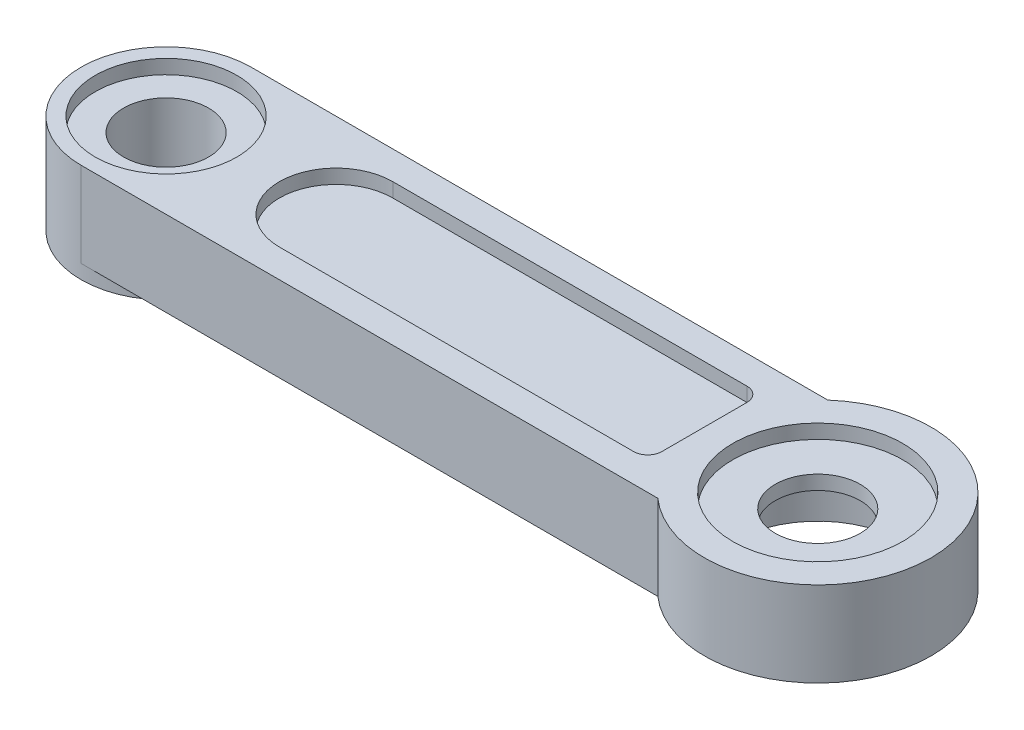
ISO-10303-21;
HEADER;
FILE_DESCRIPTION(('STEP AP214'),'2;1');
FILE_NAME('part.step','',(''),(''),'','','');
FILE_SCHEMA(('AUTOMOTIVE_DESIGN { 1 0 10303 214 1 1 1 1 }'));
ENDSEC;
DATA;
#1=APPLICATION_CONTEXT('core data for automotive mechanical design processes');
#2=APPLICATION_PROTOCOL_DEFINITION('international standard','automotive_design',2000,#1);
#3=PRODUCT_CONTEXT('',#1,'mechanical');
#4=PRODUCT('Part','Part','',(#3));
#5=PRODUCT_RELATED_PRODUCT_CATEGORY('part','',(#4));
#6=PRODUCT_DEFINITION_FORMATION('','',#4);
#7=PRODUCT_DEFINITION_CONTEXT('part definition',#1,'design');
#8=PRODUCT_DEFINITION('design','',#6,#7);
#9=PRODUCT_DEFINITION_SHAPE('','',#8);
#10=(LENGTH_UNIT() NAMED_UNIT(*) SI_UNIT(.MILLI.,.METRE.));
#11=(NAMED_UNIT(*) PLANE_ANGLE_UNIT() SI_UNIT($,.RADIAN.));
#12=(NAMED_UNIT(*) SI_UNIT($,.STERADIAN.) SOLID_ANGLE_UNIT());
#13=UNCERTAINTY_MEASURE_WITH_UNIT(LENGTH_MEASURE(1.E-05),#10,'distance_accuracy_value','');
#14=(GEOMETRIC_REPRESENTATION_CONTEXT(3) GLOBAL_UNCERTAINTY_ASSIGNED_CONTEXT((#13)) GLOBAL_UNIT_ASSIGNED_CONTEXT((#10,
#11,#12)) REPRESENTATION_CONTEXT('',''));
#15=CARTESIAN_POINT('',(0.,0.,0.));
#16=DIRECTION('',(0.,0.,1.));
#17=DIRECTION('',(1.,0.,0.));
#18=AXIS2_PLACEMENT_3D('',#15,#16,#17);
#19=CARTESIAN_POINT('',(0.,-3.,0.));
#20=DIRECTION('',(0.,1.,0.));
#21=DIRECTION('',(0.,0.,1.));
#22=AXIS2_PLACEMENT_3D('',#19,#20,#21);
#23=CYLINDRICAL_SURFACE('',#22,1.5);
#24=CARTESIAN_POINT('',(0.,-0.5,0.));
#25=DIRECTION('',(0.,1.,0.));
#26=DIRECTION('',(0.,0.,1.));
#27=AXIS2_PLACEMENT_3D('',#24,#25,#26);
#28=CIRCLE('',#27,1.5);
#29=CARTESIAN_POINT('',(0.,-0.5,1.5));
#30=VERTEX_POINT('',#29);
#31=EDGE_CURVE('E210',#30,#30,#28,.T.);
#32=ORIENTED_EDGE('',*,*,#31,.T.);
#33=EDGE_LOOP('',(#32));
#34=FACE_BOUND('',#33,.T.);
#35=CARTESIAN_POINT('',(0.,-1.,0.));
#36=DIRECTION('',(0.,-1.,0.));
#37=DIRECTION('',(0.,0.,-1.));
#38=AXIS2_PLACEMENT_3D('',#35,#36,#37);
#39=CIRCLE('',#38,1.5);
#40=CARTESIAN_POINT('',(0.,-1.,-1.5));
#41=VERTEX_POINT('',#40);
#42=EDGE_CURVE('E36',#41,#41,#39,.F.);
#43=ORIENTED_EDGE('',*,*,#42,.F.);
#44=EDGE_LOOP('',(#43));
#45=FACE_BOUND('',#44,.T.);
#46=ADVANCED_FACE('F32',(#34,#45),#23,.F.);
#47=CARTESIAN_POINT('',(0.,-3.,0.));
#48=DIRECTION('',(0.,1.,0.));
#49=DIRECTION('',(0.,0.,1.));
#50=AXIS2_PLACEMENT_3D('',#47,#48,#49);
#51=CYLINDRICAL_SURFACE('',#50,4.);
#52=DIRECTION('',(0.,1.,0.));
#53=VECTOR('',#52,1.);
#54=CARTESIAN_POINT('',(-2.64575131106459,-3.,3.));
#55=LINE('',#54,#53);
#56=CARTESIAN_POINT('',(-2.6457513110646,-3.,3.));
#57=VERTEX_POINT('',#56);
#58=CARTESIAN_POINT('',(-2.64575131106459,0.,3.));
#59=VERTEX_POINT('',#58);
#60=EDGE_CURVE('E185',#57,#59,#55,.T.);
#61=ORIENTED_EDGE('',*,*,#60,.F.);
#62=CARTESIAN_POINT('',(0.,-3.,0.));
#63=DIRECTION('',(0.,1.,0.));
#64=DIRECTION('',(0.,0.,1.));
#65=AXIS2_PLACEMENT_3D('',#62,#63,#64);
#66=CIRCLE('',#65,4.);
#67=CARTESIAN_POINT('',(-2.6457513110646,-3.,-2.99999999999999));
#68=VERTEX_POINT('',#67);
#69=EDGE_CURVE('E11',#57,#68,#66,.T.);
#70=ORIENTED_EDGE('',*,*,#69,.T.);
#71=DIRECTION('',(0.,1.,0.));
#72=VECTOR('',#71,1.);
#73=CARTESIAN_POINT('',(-2.6457513110646,-3.,-2.99999999999999));
#74=LINE('',#73,#72);
#75=CARTESIAN_POINT('',(-2.6457513110646,0.,-2.99999999999999));
#76=VERTEX_POINT('',#75);
#77=EDGE_CURVE('E171',#76,#68,#74,.F.);
#78=ORIENTED_EDGE('',*,*,#77,.F.);
#79=CARTESIAN_POINT('',(0.,0.,0.));
#80=DIRECTION('',(0.,1.,0.));
#81=DIRECTION('',(0.,0.,1.));
#82=AXIS2_PLACEMENT_3D('',#79,#80,#81);
#83=CIRCLE('',#82,4.);
#84=EDGE_CURVE('E41',#59,#76,#83,.T.);
#85=ORIENTED_EDGE('',*,*,#84,.F.);
#86=EDGE_LOOP('',(#61,#70,#78,#85));
#87=FACE_BOUND('',#86,.T.);
#88=ADVANCED_FACE('F34',(#87),#51,.T.);
#89=CARTESIAN_POINT('',(0.,-3.,0.));
#90=DIRECTION('',(0.,1.,0.));
#91=DIRECTION('',(0.,0.,1.));
#92=AXIS2_PLACEMENT_3D('',#89,#90,#91);
#93=PLANE('',#92);
#94=DIRECTION('',(1.,0.,0.));
#95=VECTOR('',#94,1.);
#96=CARTESIAN_POINT('',(-4.5,-3.,-2.));
#97=LINE('',#96,#95);
#98=CARTESIAN_POINT('',(-15.,-3.,-2.));
#99=VERTEX_POINT('',#98);
#100=CARTESIAN_POINT('',(-4.5,-3.,-2.));
#101=VERTEX_POINT('',#100);
#102=EDGE_CURVE('E542',#99,#101,#97,.T.);
#103=ORIENTED_EDGE('',*,*,#102,.F.);
#104=CARTESIAN_POINT('',(-15.,-3.,0.));
#105=DIRECTION('',(0.,-1.,0.));
#106=DIRECTION('',(0.,0.,-1.));
#107=AXIS2_PLACEMENT_3D('',#104,#105,#106);
#108=CIRCLE('',#107,2.);
#109=CARTESIAN_POINT('',(-15.,-3.,2.));
#110=VERTEX_POINT('',#109);
#111=EDGE_CURVE('E49',#110,#99,#108,.T.);
#112=ORIENTED_EDGE('',*,*,#111,.F.);
#113=DIRECTION('',(-1.,0.,0.));
#114=VECTOR('',#113,1.);
#115=CARTESIAN_POINT('',(-4.5,-3.,2.));
#116=LINE('',#115,#114);
#117=CARTESIAN_POINT('',(-4.5,-3.,2.));
#118=VERTEX_POINT('',#117);
#119=EDGE_CURVE('E525',#118,#110,#116,.T.);
#120=ORIENTED_EDGE('',*,*,#119,.F.);
#121=CARTESIAN_POINT('',(-4.5,-3.,1.5));
#122=DIRECTION('',(0.,-1.,0.));
#123=DIRECTION('',(0.,0.,-1.));
#124=AXIS2_PLACEMENT_3D('',#121,#122,#123);
#125=CIRCLE('',#124,0.5);
#126=CARTESIAN_POINT('',(-4.,-3.,1.5));
#127=VERTEX_POINT('',#126);
#128=EDGE_CURVE('E551',#127,#118,#125,.T.);
#129=ORIENTED_EDGE('',*,*,#128,.F.);
#130=DIRECTION('',(0.,0.,1.));
#131=VECTOR('',#130,1.);
#132=CARTESIAN_POINT('',(-4.,-3.,-1.5));
#133=LINE('',#132,#131);
#134=CARTESIAN_POINT('',(-4.,-3.,-1.5));
#135=VERTEX_POINT('',#134);
#136=EDGE_CURVE('E548',#135,#127,#133,.T.);
#137=ORIENTED_EDGE('',*,*,#136,.F.);
#138=CARTESIAN_POINT('',(-4.5,-3.,-1.5));
#139=DIRECTION('',(0.,-1.,0.));
#140=DIRECTION('',(0.,0.,-1.));
#141=AXIS2_PLACEMENT_3D('',#138,#139,#140);
#142=CIRCLE('',#141,0.5);
#143=EDGE_CURVE('E545',#101,#135,#142,.T.);
#144=ORIENTED_EDGE('',*,*,#143,.F.);
#145=EDGE_LOOP('',(#103,#112,#120,#129,#137,#144));
#146=FACE_BOUND('',#145,.T.);
#147=CARTESIAN_POINT('',(0.,-3.,0.));
#148=DIRECTION('',(0.,-1.,0.));
#149=DIRECTION('',(0.,0.,-1.));
#150=AXIS2_PLACEMENT_3D('',#147,#148,#149);
#151=CIRCLE('',#150,3.);
#152=CARTESIAN_POINT('',(0.,-3.,-3.));
#153=VERTEX_POINT('',#152);
#154=EDGE_CURVE('E197',#153,#153,#151,.T.);
#155=ORIENTED_EDGE('',*,*,#154,.F.);
#156=EDGE_LOOP('',(#155));
#157=FACE_BOUND('',#156,.T.);
#158=DIRECTION('',(1.,0.,0.));
#159=VECTOR('',#158,1.);
#160=CARTESIAN_POINT('',(-23.,-3.,3.00000000000001));
#161=LINE('',#160,#159);
#162=CARTESIAN_POINT('',(-23.,-3.,2.99999999999999));
#163=VERTEX_POINT('',#162);
#164=EDGE_CURVE('E153',#163,#57,#161,.T.);
#165=ORIENTED_EDGE('',*,*,#164,.F.);
#166=CARTESIAN_POINT('',(-23.,-3.,0.));
#167=DIRECTION('',(0.,1.,0.));
#168=DIRECTION('',(0.,0.,1.));
#169=AXIS2_PLACEMENT_3D('',#166,#167,#168);
#170=CIRCLE('',#169,2.99999999999999);
#171=CARTESIAN_POINT('',(-23.,-3.,-2.99999999999999));
#172=VERTEX_POINT('',#171);
#173=EDGE_CURVE('E147',#163,#172,#170,.T.);
#174=ORIENTED_EDGE('',*,*,#173,.T.);
#175=DIRECTION('',(-1.,0.,0.));
#176=VECTOR('',#175,1.);
#177=CARTESIAN_POINT('',(-23.,-3.,-2.99999999999999));
#178=LINE('',#177,#176);
#179=EDGE_CURVE('E152',#68,#172,#178,.T.);
#180=ORIENTED_EDGE('',*,*,#179,.F.);
#181=ORIENTED_EDGE('',*,*,#69,.F.);
#182=EDGE_LOOP('',(#165,#174,#180,#181));
#183=FACE_BOUND('',#182,.T.);
#184=ADVANCED_FACE('F149',(#146,#157,#183),#93,.F.);
#185=CARTESIAN_POINT('',(0.,0.,0.));
#186=DIRECTION('',(0.,1.,0.));
#187=DIRECTION('',(0.,0.,1.));
#188=AXIS2_PLACEMENT_3D('',#185,#186,#187);
#189=PLANE('',#188);
#190=CARTESIAN_POINT('',(-17.,0.,0.));
#191=DIRECTION('',(0.,1.,0.));
#192=DIRECTION('',(0.,0.,1.));
#193=AXIS2_PLACEMENT_3D('',#190,#191,#192);
#194=CIRCLE('',#193,2.);
#195=CARTESIAN_POINT('',(-17.,0.,-2.));
#196=VERTEX_POINT('',#195);
#197=CARTESIAN_POINT('',(-17.,0.,2.));
#198=VERTEX_POINT('',#197);
#199=EDGE_CURVE('E57',#196,#198,#194,.T.);
#200=ORIENTED_EDGE('',*,*,#199,.F.);
#201=DIRECTION('',(-1.,0.,0.));
#202=VECTOR('',#201,1.);
#203=CARTESIAN_POINT('',(-4.5,0.,-2.));
#204=LINE('',#203,#202);
#205=CARTESIAN_POINT('',(-4.5,0.,-2.));
#206=VERTEX_POINT('',#205);
#207=EDGE_CURVE('E571',#206,#196,#204,.T.);
#208=ORIENTED_EDGE('',*,*,#207,.F.);
#209=CARTESIAN_POINT('',(-4.5,0.,-1.5));
#210=DIRECTION('',(0.,1.,0.));
#211=DIRECTION('',(0.,0.,-1.));
#212=AXIS2_PLACEMENT_3D('',#209,#210,#211);
#213=CIRCLE('',#212,0.5);
#214=CARTESIAN_POINT('',(-4.,0.,-1.5));
#215=VERTEX_POINT('',#214);
#216=EDGE_CURVE('E597',#215,#206,#213,.T.);
#217=ORIENTED_EDGE('',*,*,#216,.F.);
#218=DIRECTION('',(0.,0.,-1.));
#219=VECTOR('',#218,1.);
#220=CARTESIAN_POINT('',(-4.,0.,1.5));
#221=LINE('',#220,#219);
#222=CARTESIAN_POINT('',(-4.,0.,1.5));
#223=VERTEX_POINT('',#222);
#224=EDGE_CURVE('E594',#223,#215,#221,.T.);
#225=ORIENTED_EDGE('',*,*,#224,.F.);
#226=CARTESIAN_POINT('',(-4.5,0.,1.5));
#227=DIRECTION('',(0.,1.,0.));
#228=DIRECTION('',(0.,0.,1.));
#229=AXIS2_PLACEMENT_3D('',#226,#227,#228);
#230=CIRCLE('',#229,0.5);
#231=CARTESIAN_POINT('',(-4.5,0.,2.));
#232=VERTEX_POINT('',#231);
#233=EDGE_CURVE('E591',#232,#223,#230,.T.);
#234=ORIENTED_EDGE('',*,*,#233,.F.);
#235=DIRECTION('',(1.,0.,0.));
#236=VECTOR('',#235,1.);
#237=CARTESIAN_POINT('',(-4.5,0.,2.));
#238=LINE('',#237,#236);
#239=EDGE_CURVE('E588',#198,#232,#238,.T.);
#240=ORIENTED_EDGE('',*,*,#239,.F.);
#241=EDGE_LOOP('',(#200,#208,#217,#225,#234,#240));
#242=FACE_BOUND('',#241,.T.);
#243=CARTESIAN_POINT('',(-23.,0.,0.));
#244=DIRECTION('',(0.,1.,0.));
#245=DIRECTION('',(0.,0.,1.));
#246=AXIS2_PLACEMENT_3D('',#243,#244,#245);
#247=CIRCLE('',#246,2.5);
#248=CARTESIAN_POINT('',(-23.,0.,2.5));
#249=VERTEX_POINT('',#248);
#250=EDGE_CURVE('E204',#249,#249,#247,.T.);
#251=ORIENTED_EDGE('',*,*,#250,.F.);
#252=EDGE_LOOP('',(#251));
#253=FACE_BOUND('',#252,.T.);
#254=DIRECTION('',(-1.,0.,0.));
#255=VECTOR('',#254,1.);
#256=CARTESIAN_POINT('',(-23.,0.,-2.99999999999999));
#257=LINE('',#256,#255);
#258=CARTESIAN_POINT('',(-23.,0.,-2.99999999999999));
#259=VERTEX_POINT('',#258);
#260=EDGE_CURVE('E175',#76,#259,#257,.T.);
#261=ORIENTED_EDGE('',*,*,#260,.T.);
#262=CARTESIAN_POINT('',(-23.,0.,0.));
#263=DIRECTION('',(0.,1.,0.));
#264=DIRECTION('',(0.,0.,1.));
#265=AXIS2_PLACEMENT_3D('',#262,#263,#264);
#266=CIRCLE('',#265,2.99999999999999);
#267=CARTESIAN_POINT('',(-23.,0.,2.99999999999999));
#268=VERTEX_POINT('',#267);
#269=EDGE_CURVE('E164',#259,#268,#266,.T.);
#270=ORIENTED_EDGE('',*,*,#269,.T.);
#271=DIRECTION('',(1.,0.,0.));
#272=VECTOR('',#271,1.);
#273=CARTESIAN_POINT('',(-23.,0.,3.00000000000001));
#274=LINE('',#273,#272);
#275=EDGE_CURVE('E172',#268,#59,#274,.T.);
#276=ORIENTED_EDGE('',*,*,#275,.T.);
#277=ORIENTED_EDGE('',*,*,#84,.T.);
#278=EDGE_LOOP('',(#261,#270,#276,#277));
#279=FACE_BOUND('',#278,.T.);
#280=CARTESIAN_POINT('',(0.,0.,0.));
#281=DIRECTION('',(0.,1.,0.));
#282=DIRECTION('',(0.,0.,1.));
#283=AXIS2_PLACEMENT_3D('',#280,#281,#282);
#284=CIRCLE('',#283,3.);
#285=CARTESIAN_POINT('',(0.,0.,3.));
#286=VERTEX_POINT('',#285);
#287=EDGE_CURVE('E178',#286,#286,#284,.T.);
#288=ORIENTED_EDGE('',*,*,#287,.F.);
#289=EDGE_LOOP('',(#288));
#290=FACE_BOUND('',#289,.T.);
#291=ADVANCED_FACE('F190',(#242,#253,#279,#290),#189,.T.);
#292=CARTESIAN_POINT('',(-23.,-3.,3.00000000000001));
#293=DIRECTION('',(0.,0.,1.));
#294=DIRECTION('',(1.,0.,0.));
#295=AXIS2_PLACEMENT_3D('',#292,#293,#294);
#296=PLANE('',#295);
#297=ORIENTED_EDGE('',*,*,#164,.T.);
#298=ORIENTED_EDGE('',*,*,#60,.T.);
#299=ORIENTED_EDGE('',*,*,#275,.F.);
#300=DIRECTION('',(0.,1.,0.));
#301=VECTOR('',#300,1.);
#302=CARTESIAN_POINT('',(-23.,-3.,3.00000000000001));
#303=LINE('',#302,#301);
#304=EDGE_CURVE('E167',#163,#268,#303,.T.);
#305=ORIENTED_EDGE('',*,*,#304,.F.);
#306=EDGE_LOOP('',(#297,#298,#299,#305));
#307=FACE_BOUND('',#306,.T.);
#308=ADVANCED_FACE('F196',(#307),#296,.T.);
#309=CARTESIAN_POINT('',(-23.,-3.,-2.99999999999999));
#310=DIRECTION('',(0.,0.,-1.));
#311=DIRECTION('',(-1.,0.,0.));
#312=AXIS2_PLACEMENT_3D('',#309,#310,#311);
#313=PLANE('',#312);
#314=ORIENTED_EDGE('',*,*,#260,.F.);
#315=ORIENTED_EDGE('',*,*,#77,.T.);
#316=ORIENTED_EDGE('',*,*,#179,.T.);
#317=DIRECTION('',(0.,1.,0.));
#318=VECTOR('',#317,1.);
#319=CARTESIAN_POINT('',(-23.,-3.,-2.99999999999999));
#320=LINE('',#319,#318);
#321=EDGE_CURVE('E160',#172,#259,#320,.T.);
#322=ORIENTED_EDGE('',*,*,#321,.T.);
#323=EDGE_LOOP('',(#314,#315,#316,#322));
#324=FACE_BOUND('',#323,.T.);
#325=ADVANCED_FACE('F169',(#324),#313,.T.);
#326=CARTESIAN_POINT('',(0.,-0.5,0.));
#327=DIRECTION('',(0.,1.,0.));
#328=DIRECTION('',(0.,0.,1.));
#329=AXIS2_PLACEMENT_3D('',#326,#327,#328);
#330=CYLINDRICAL_SURFACE('',#329,3.);
#331=CARTESIAN_POINT('',(0.,-0.5,0.));
#332=DIRECTION('',(0.,1.,0.));
#333=DIRECTION('',(0.,0.,1.));
#334=AXIS2_PLACEMENT_3D('',#331,#332,#333);
#335=CIRCLE('',#334,3.);
#336=CARTESIAN_POINT('',(0.,-0.5,3.));
#337=VERTEX_POINT('',#336);
#338=EDGE_CURVE('E181',#337,#337,#335,.T.);
#339=ORIENTED_EDGE('',*,*,#338,.F.);
#340=EDGE_LOOP('',(#339));
#341=FACE_BOUND('',#340,.T.);
#342=ORIENTED_EDGE('',*,*,#287,.T.);
#343=EDGE_LOOP('',(#342));
#344=FACE_BOUND('',#343,.T.);
#345=ADVANCED_FACE('F218',(#341,#344),#330,.F.);
#346=CARTESIAN_POINT('',(0.,-0.5,0.));
#347=DIRECTION('',(0.,1.,0.));
#348=DIRECTION('',(0.,0.,1.));
#349=AXIS2_PLACEMENT_3D('',#346,#347,#348);
#350=PLANE('',#349);
#351=ORIENTED_EDGE('',*,*,#31,.F.);
#352=EDGE_LOOP('',(#351));
#353=FACE_BOUND('',#352,.T.);
#354=ORIENTED_EDGE('',*,*,#338,.T.);
#355=EDGE_LOOP('',(#354));
#356=FACE_BOUND('',#355,.T.);
#357=ADVANCED_FACE('F240',(#353,#356),#350,.T.);
#358=CARTESIAN_POINT('',(0.,-1.,0.));
#359=DIRECTION('',(0.,-1.,0.));
#360=DIRECTION('',(0.,0.,-1.));
#361=AXIS2_PLACEMENT_3D('',#358,#359,#360);
#362=PLANE('',#361);
#363=CARTESIAN_POINT('',(0.,-1.,0.));
#364=DIRECTION('',(0.,-1.,0.));
#365=DIRECTION('',(0.,0.,-1.));
#366=AXIS2_PLACEMENT_3D('',#363,#364,#365);
#367=CIRCLE('',#366,3.);
#368=CARTESIAN_POINT('',(0.,-1.,-3.));
#369=VERTEX_POINT('',#368);
#370=EDGE_CURVE('E201',#369,#369,#367,.T.);
#371=ORIENTED_EDGE('',*,*,#370,.T.);
#372=EDGE_LOOP('',(#371));
#373=FACE_BOUND('',#372,.T.);
#374=ORIENTED_EDGE('',*,*,#42,.T.);
#375=EDGE_LOOP('',(#374));
#376=FACE_BOUND('',#375,.T.);
#377=ADVANCED_FACE('F243',(#373,#376),#362,.T.);
#378=CARTESIAN_POINT('',(0.,-1.,0.));
#379=DIRECTION('',(0.,-1.,0.));
#380=DIRECTION('',(0.,0.,-1.));
#381=AXIS2_PLACEMENT_3D('',#378,#379,#380);
#382=CYLINDRICAL_SURFACE('',#381,3.);
#383=ORIENTED_EDGE('',*,*,#370,.F.);
#384=EDGE_LOOP('',(#383));
#385=FACE_BOUND('',#384,.T.);
#386=ORIENTED_EDGE('',*,*,#154,.T.);
#387=EDGE_LOOP('',(#386));
#388=FACE_BOUND('',#387,.T.);
#389=ADVANCED_FACE('F238',(#385,#388),#382,.F.);
#390=CARTESIAN_POINT('',(-23.,-3.,0.));
#391=DIRECTION('',(0.,1.,0.));
#392=DIRECTION('',(0.,0.,1.));
#393=AXIS2_PLACEMENT_3D('',#390,#391,#392);
#394=CYLINDRICAL_SURFACE('',#393,2.99999999999999);
#395=ORIENTED_EDGE('',*,*,#321,.F.);
#396=ORIENTED_EDGE('',*,*,#173,.F.);
#397=ORIENTED_EDGE('',*,*,#304,.T.);
#398=ORIENTED_EDGE('',*,*,#269,.F.);
#399=EDGE_LOOP('',(#395,#396,#397,#398));
#400=FACE_BOUND('',#399,.T.);
#401=CARTESIAN_POINT('',(-23.,-3.5,0.));
#402=DIRECTION('',(0.,1.,0.));
#403=DIRECTION('',(0.,0.,1.));
#404=AXIS2_PLACEMENT_3D('',#401,#402,#403);
#405=CIRCLE('',#404,2.99999999999999);
#406=CARTESIAN_POINT('',(-23.,-3.5,2.99999999999999));
#407=VERTEX_POINT('',#406);
#408=EDGE_CURVE('E156',#407,#407,#405,.T.);
#409=ORIENTED_EDGE('',*,*,#408,.T.);
#410=EDGE_LOOP('',(#409));
#411=FACE_BOUND('',#410,.T.);
#412=ADVANCED_FACE('F161',(#400,#411),#394,.T.);
#413=CARTESIAN_POINT('',(-23.,-0.5,0.));
#414=DIRECTION('',(0.,1.,0.));
#415=DIRECTION('',(0.,0.,1.));
#416=AXIS2_PLACEMENT_3D('',#413,#414,#415);
#417=CYLINDRICAL_SURFACE('',#416,2.5);
#418=CARTESIAN_POINT('',(-23.,-0.5,0.));
#419=DIRECTION('',(0.,1.,0.));
#420=DIRECTION('',(0.,0.,1.));
#421=AXIS2_PLACEMENT_3D('',#418,#419,#420);
#422=CIRCLE('',#421,2.5);
#423=CARTESIAN_POINT('',(-23.,-0.5,2.5));
#424=VERTEX_POINT('',#423);
#425=EDGE_CURVE('E198',#424,#424,#422,.T.);
#426=ORIENTED_EDGE('',*,*,#425,.F.);
#427=EDGE_LOOP('',(#426));
#428=FACE_BOUND('',#427,.T.);
#429=ORIENTED_EDGE('',*,*,#250,.T.);
#430=EDGE_LOOP('',(#429));
#431=FACE_BOUND('',#430,.T.);
#432=ADVANCED_FACE('F281',(#428,#431),#417,.F.);
#433=CARTESIAN_POINT('',(-23.,-0.5,0.));
#434=DIRECTION('',(0.,1.,0.));
#435=DIRECTION('',(0.,0.,1.));
#436=AXIS2_PLACEMENT_3D('',#433,#434,#435);
#437=PLANE('',#436);
#438=CARTESIAN_POINT('',(-23.,-0.5,0.));
#439=DIRECTION('',(0.,1.,0.));
#440=DIRECTION('',(0.,0.,1.));
#441=AXIS2_PLACEMENT_3D('',#438,#439,#440);
#442=CIRCLE('',#441,1.5);
#443=CARTESIAN_POINT('',(-23.,-0.5,1.5));
#444=VERTEX_POINT('',#443);
#445=EDGE_CURVE('E515',#444,#444,#442,.T.);
#446=ORIENTED_EDGE('',*,*,#445,.F.);
#447=EDGE_LOOP('',(#446));
#448=FACE_BOUND('',#447,.T.);
#449=ORIENTED_EDGE('',*,*,#425,.T.);
#450=EDGE_LOOP('',(#449));
#451=FACE_BOUND('',#450,.T.);
#452=ADVANCED_FACE('F288',(#448,#451),#437,.T.);
#453=CARTESIAN_POINT('',(-17.,-0.5,0.));
#454=DIRECTION('',(0.,1.,0.));
#455=DIRECTION('',(0.,0.,1.));
#456=AXIS2_PLACEMENT_3D('',#453,#454,#455);
#457=CYLINDRICAL_SURFACE('',#456,2.);
#458=ORIENTED_EDGE('',*,*,#199,.T.);
#459=DIRECTION('',(0.,1.,0.));
#460=VECTOR('',#459,1.);
#461=CARTESIAN_POINT('',(-17.,-0.5,2.));
#462=LINE('',#461,#460);
#463=CARTESIAN_POINT('',(-17.,-0.5,2.));
#464=VERTEX_POINT('',#463);
#465=EDGE_CURVE('E586',#464,#198,#462,.T.);
#466=ORIENTED_EDGE('',*,*,#465,.F.);
#467=CARTESIAN_POINT('',(-17.,-0.5,0.));
#468=DIRECTION('',(0.,1.,0.));
#469=DIRECTION('',(0.,0.,1.));
#470=AXIS2_PLACEMENT_3D('',#467,#468,#469);
#471=CIRCLE('',#470,2.);
#472=CARTESIAN_POINT('',(-17.,-0.5,-2.));
#473=VERTEX_POINT('',#472);
#474=EDGE_CURVE('E567',#473,#464,#471,.T.);
#475=ORIENTED_EDGE('',*,*,#474,.F.);
#476=DIRECTION('',(0.,1.,0.));
#477=VECTOR('',#476,1.);
#478=CARTESIAN_POINT('',(-17.,-0.5,-2.));
#479=LINE('',#478,#477);
#480=EDGE_CURVE('E602',#473,#196,#479,.T.);
#481=ORIENTED_EDGE('',*,*,#480,.T.);
#482=EDGE_LOOP('',(#458,#466,#475,#481));
#483=FACE_BOUND('',#482,.T.);
#484=ADVANCED_FACE('F295',(#483),#457,.F.);
#485=CARTESIAN_POINT('',(-4.5,-0.5,-2.));
#486=DIRECTION('',(0.,0.,-1.));
#487=DIRECTION('',(-1.,0.,0.));
#488=AXIS2_PLACEMENT_3D('',#485,#486,#487);
#489=PLANE('',#488);
#490=ORIENTED_EDGE('',*,*,#207,.T.);
#491=ORIENTED_EDGE('',*,*,#480,.F.);
#492=DIRECTION('',(-1.,0.,0.));
#493=VECTOR('',#492,1.);
#494=CARTESIAN_POINT('',(-4.5,-0.5,-2.));
#495=LINE('',#494,#493);
#496=CARTESIAN_POINT('',(-4.5,-0.5,-2.));
#497=VERTEX_POINT('',#496);
#498=EDGE_CURVE('E583',#497,#473,#495,.T.);
#499=ORIENTED_EDGE('',*,*,#498,.F.);
#500=DIRECTION('',(0.,1.,0.));
#501=VECTOR('',#500,1.);
#502=CARTESIAN_POINT('',(-4.5,-0.5,-2.));
#503=LINE('',#502,#501);
#504=EDGE_CURVE('E604',#497,#206,#503,.T.);
#505=ORIENTED_EDGE('',*,*,#504,.T.);
#506=EDGE_LOOP('',(#490,#491,#499,#505));
#507=FACE_BOUND('',#506,.T.);
#508=ADVANCED_FACE('F304',(#507),#489,.F.);
#509=CARTESIAN_POINT('',(-4.5,-0.5,-1.5));
#510=DIRECTION('',(0.,1.,0.));
#511=DIRECTION('',(0.,0.,1.));
#512=AXIS2_PLACEMENT_3D('',#509,#510,#511);
#513=CYLINDRICAL_SURFACE('',#512,0.5);
#514=ORIENTED_EDGE('',*,*,#216,.T.);
#515=ORIENTED_EDGE('',*,*,#504,.F.);
#516=CARTESIAN_POINT('',(-4.5,-0.5,-1.5));
#517=DIRECTION('',(0.,1.,0.));
#518=DIRECTION('',(0.,0.,-1.));
#519=AXIS2_PLACEMENT_3D('',#516,#517,#518);
#520=CIRCLE('',#519,0.5);
#521=CARTESIAN_POINT('',(-4.,-0.5,-1.5));
#522=VERTEX_POINT('',#521);
#523=EDGE_CURVE('E580',#522,#497,#520,.T.);
#524=ORIENTED_EDGE('',*,*,#523,.F.);
#525=DIRECTION('',(0.,1.,0.));
#526=VECTOR('',#525,1.);
#527=CARTESIAN_POINT('',(-4.,-0.5,-1.5));
#528=LINE('',#527,#526);
#529=EDGE_CURVE('E606',#522,#215,#528,.T.);
#530=ORIENTED_EDGE('',*,*,#529,.T.);
#531=EDGE_LOOP('',(#514,#515,#524,#530));
#532=FACE_BOUND('',#531,.T.);
#533=ADVANCED_FACE('F311',(#532),#513,.F.);
#534=CARTESIAN_POINT('',(-4.,-0.5,1.5));
#535=DIRECTION('',(1.,0.,0.));
#536=DIRECTION('',(0.,0.,-1.));
#537=AXIS2_PLACEMENT_3D('',#534,#535,#536);
#538=PLANE('',#537);
#539=ORIENTED_EDGE('',*,*,#224,.T.);
#540=ORIENTED_EDGE('',*,*,#529,.F.);
#541=DIRECTION('',(0.,0.,-1.));
#542=VECTOR('',#541,1.);
#543=CARTESIAN_POINT('',(-4.,-0.5,1.5));
#544=LINE('',#543,#542);
#545=CARTESIAN_POINT('',(-4.,-0.5,1.5));
#546=VERTEX_POINT('',#545);
#547=EDGE_CURVE('E577',#546,#522,#544,.T.);
#548=ORIENTED_EDGE('',*,*,#547,.F.);
#549=DIRECTION('',(0.,1.,0.));
#550=VECTOR('',#549,1.);
#551=CARTESIAN_POINT('',(-4.,-0.5,1.5));
#552=LINE('',#551,#550);
#553=EDGE_CURVE('E608',#546,#223,#552,.T.);
#554=ORIENTED_EDGE('',*,*,#553,.T.);
#555=EDGE_LOOP('',(#539,#540,#548,#554));
#556=FACE_BOUND('',#555,.T.);
#557=ADVANCED_FACE('F319',(#556),#538,.F.);
#558=CARTESIAN_POINT('',(-4.5,-0.5,1.5));
#559=DIRECTION('',(0.,1.,0.));
#560=DIRECTION('',(0.,0.,1.));
#561=AXIS2_PLACEMENT_3D('',#558,#559,#560);
#562=CYLINDRICAL_SURFACE('',#561,0.5);
#563=ORIENTED_EDGE('',*,*,#233,.T.);
#564=ORIENTED_EDGE('',*,*,#553,.F.);
#565=CARTESIAN_POINT('',(-4.5,-0.5,1.5));
#566=DIRECTION('',(0.,1.,0.));
#567=DIRECTION('',(0.,0.,1.));
#568=AXIS2_PLACEMENT_3D('',#565,#566,#567);
#569=CIRCLE('',#568,0.5);
#570=CARTESIAN_POINT('',(-4.5,-0.5,2.));
#571=VERTEX_POINT('',#570);
#572=EDGE_CURVE('E574',#571,#546,#569,.T.);
#573=ORIENTED_EDGE('',*,*,#572,.F.);
#574=DIRECTION('',(0.,1.,0.));
#575=VECTOR('',#574,1.);
#576=CARTESIAN_POINT('',(-4.5,-0.5,2.));
#577=LINE('',#576,#575);
#578=EDGE_CURVE('E610',#571,#232,#577,.T.);
#579=ORIENTED_EDGE('',*,*,#578,.T.);
#580=EDGE_LOOP('',(#563,#564,#573,#579));
#581=FACE_BOUND('',#580,.T.);
#582=ADVANCED_FACE('F327',(#581),#562,.F.);
#583=CARTESIAN_POINT('',(-4.5,-0.5,2.));
#584=DIRECTION('',(0.,0.,1.));
#585=DIRECTION('',(1.,0.,0.));
#586=AXIS2_PLACEMENT_3D('',#583,#584,#585);
#587=PLANE('',#586);
#588=ORIENTED_EDGE('',*,*,#239,.T.);
#589=ORIENTED_EDGE('',*,*,#578,.F.);
#590=DIRECTION('',(1.,0.,0.));
#591=VECTOR('',#590,1.);
#592=CARTESIAN_POINT('',(-4.5,-0.5,2.));
#593=LINE('',#592,#591);
#594=EDGE_CURVE('E570',#464,#571,#593,.T.);
#595=ORIENTED_EDGE('',*,*,#594,.F.);
#596=ORIENTED_EDGE('',*,*,#465,.T.);
#597=EDGE_LOOP('',(#588,#589,#595,#596));
#598=FACE_BOUND('',#597,.T.);
#599=ADVANCED_FACE('F335',(#598),#587,.F.);
#600=CARTESIAN_POINT('',(-17.,-0.5,0.));
#601=DIRECTION('',(0.,1.,0.));
#602=DIRECTION('',(0.,0.,1.));
#603=AXIS2_PLACEMENT_3D('',#600,#601,#602);
#604=PLANE('',#603);
#605=ORIENTED_EDGE('',*,*,#474,.T.);
#606=ORIENTED_EDGE('',*,*,#594,.T.);
#607=ORIENTED_EDGE('',*,*,#572,.T.);
#608=ORIENTED_EDGE('',*,*,#547,.T.);
#609=ORIENTED_EDGE('',*,*,#523,.T.);
#610=ORIENTED_EDGE('',*,*,#498,.T.);
#611=EDGE_LOOP('',(#605,#606,#607,#608,#609,#610));
#612=FACE_BOUND('',#611,.T.);
#613=ADVANCED_FACE('F343',(#612),#604,.T.);
#614=CARTESIAN_POINT('',(-15.,-2.5,0.));
#615=DIRECTION('',(0.,-1.,0.));
#616=DIRECTION('',(0.,0.,-1.));
#617=AXIS2_PLACEMENT_3D('',#614,#615,#616);
#618=CYLINDRICAL_SURFACE('',#617,2.);
#619=ORIENTED_EDGE('',*,*,#111,.T.);
#620=DIRECTION('',(0.,-1.,0.));
#621=VECTOR('',#620,1.);
#622=CARTESIAN_POINT('',(-15.,-2.5,-2.));
#623=LINE('',#622,#621);
#624=CARTESIAN_POINT('',(-15.,-2.5,-2.));
#625=VERTEX_POINT('',#624);
#626=EDGE_CURVE('E540',#625,#99,#623,.T.);
#627=ORIENTED_EDGE('',*,*,#626,.F.);
#628=CARTESIAN_POINT('',(-15.,-2.5,0.));
#629=DIRECTION('',(0.,-1.,0.));
#630=DIRECTION('',(0.,0.,-1.));
#631=AXIS2_PLACEMENT_3D('',#628,#629,#630);
#632=CIRCLE('',#631,2.);
#633=CARTESIAN_POINT('',(-15.,-2.5,2.));
#634=VERTEX_POINT('',#633);
#635=EDGE_CURVE('E521',#634,#625,#632,.T.);
#636=ORIENTED_EDGE('',*,*,#635,.F.);
#637=DIRECTION('',(0.,-1.,0.));
#638=VECTOR('',#637,1.);
#639=CARTESIAN_POINT('',(-15.,-2.5,2.));
#640=LINE('',#639,#638);
#641=EDGE_CURVE('E556',#634,#110,#640,.T.);
#642=ORIENTED_EDGE('',*,*,#641,.T.);
#643=EDGE_LOOP('',(#619,#627,#636,#642));
#644=FACE_BOUND('',#643,.T.);
#645=ADVANCED_FACE('F351',(#644),#618,.F.);
#646=CARTESIAN_POINT('',(-4.5,-2.5,2.));
#647=DIRECTION('',(0.,0.,1.));
#648=DIRECTION('',(1.,0.,0.));
#649=AXIS2_PLACEMENT_3D('',#646,#647,#648);
#650=PLANE('',#649);
#651=ORIENTED_EDGE('',*,*,#119,.T.);
#652=ORIENTED_EDGE('',*,*,#641,.F.);
#653=DIRECTION('',(-1.,0.,0.));
#654=VECTOR('',#653,1.);
#655=CARTESIAN_POINT('',(-4.5,-2.5,2.));
#656=LINE('',#655,#654);
#657=CARTESIAN_POINT('',(-4.5,-2.5,2.));
#658=VERTEX_POINT('',#657);
#659=EDGE_CURVE('E537',#658,#634,#656,.T.);
#660=ORIENTED_EDGE('',*,*,#659,.F.);
#661=DIRECTION('',(0.,-1.,0.));
#662=VECTOR('',#661,1.);
#663=CARTESIAN_POINT('',(-4.5,-2.5,2.));
#664=LINE('',#663,#662);
#665=EDGE_CURVE('E558',#658,#118,#664,.T.);
#666=ORIENTED_EDGE('',*,*,#665,.T.);
#667=EDGE_LOOP('',(#651,#652,#660,#666));
#668=FACE_BOUND('',#667,.T.);
#669=ADVANCED_FACE('F359',(#668),#650,.F.);
#670=CARTESIAN_POINT('',(-4.5,-2.5,1.5));
#671=DIRECTION('',(0.,-1.,0.));
#672=DIRECTION('',(0.,0.,-1.));
#673=AXIS2_PLACEMENT_3D('',#670,#671,#672);
#674=CYLINDRICAL_SURFACE('',#673,0.5);
#675=ORIENTED_EDGE('',*,*,#128,.T.);
#676=ORIENTED_EDGE('',*,*,#665,.F.);
#677=CARTESIAN_POINT('',(-4.5,-2.5,1.5));
#678=DIRECTION('',(0.,-1.,0.));
#679=DIRECTION('',(0.,0.,-1.));
#680=AXIS2_PLACEMENT_3D('',#677,#678,#679);
#681=CIRCLE('',#680,0.5);
#682=CARTESIAN_POINT('',(-4.,-2.5,1.5));
#683=VERTEX_POINT('',#682);
#684=EDGE_CURVE('E534',#683,#658,#681,.T.);
#685=ORIENTED_EDGE('',*,*,#684,.F.);
#686=DIRECTION('',(0.,-1.,0.));
#687=VECTOR('',#686,1.);
#688=CARTESIAN_POINT('',(-4.,-2.5,1.5));
#689=LINE('',#688,#687);
#690=EDGE_CURVE('E560',#683,#127,#689,.T.);
#691=ORIENTED_EDGE('',*,*,#690,.T.);
#692=EDGE_LOOP('',(#675,#676,#685,#691));
#693=FACE_BOUND('',#692,.T.);
#694=ADVANCED_FACE('F366',(#693),#674,.F.);
#695=CARTESIAN_POINT('',(-4.,-2.5,-1.5));
#696=DIRECTION('',(1.,0.,0.));
#697=DIRECTION('',(0.,0.,-1.));
#698=AXIS2_PLACEMENT_3D('',#695,#696,#697);
#699=PLANE('',#698);
#700=ORIENTED_EDGE('',*,*,#136,.T.);
#701=ORIENTED_EDGE('',*,*,#690,.F.);
#702=DIRECTION('',(0.,0.,1.));
#703=VECTOR('',#702,1.);
#704=CARTESIAN_POINT('',(-4.,-2.5,-1.5));
#705=LINE('',#704,#703);
#706=CARTESIAN_POINT('',(-4.,-2.5,-1.5));
#707=VERTEX_POINT('',#706);
#708=EDGE_CURVE('E531',#707,#683,#705,.T.);
#709=ORIENTED_EDGE('',*,*,#708,.F.);
#710=DIRECTION('',(0.,-1.,0.));
#711=VECTOR('',#710,1.);
#712=CARTESIAN_POINT('',(-4.,-2.5,-1.5));
#713=LINE('',#712,#711);
#714=EDGE_CURVE('E562',#707,#135,#713,.T.);
#715=ORIENTED_EDGE('',*,*,#714,.T.);
#716=EDGE_LOOP('',(#700,#701,#709,#715));
#717=FACE_BOUND('',#716,.T.);
#718=ADVANCED_FACE('F374',(#717),#699,.F.);
#719=CARTESIAN_POINT('',(-4.5,-2.5,-1.5));
#720=DIRECTION('',(0.,-1.,0.));
#721=DIRECTION('',(0.,0.,-1.));
#722=AXIS2_PLACEMENT_3D('',#719,#720,#721);
#723=CYLINDRICAL_SURFACE('',#722,0.5);
#724=ORIENTED_EDGE('',*,*,#143,.T.);
#725=ORIENTED_EDGE('',*,*,#714,.F.);
#726=CARTESIAN_POINT('',(-4.5,-2.5,-1.5));
#727=DIRECTION('',(0.,-1.,0.));
#728=DIRECTION('',(0.,0.,-1.));
#729=AXIS2_PLACEMENT_3D('',#726,#727,#728);
#730=CIRCLE('',#729,0.5);
#731=CARTESIAN_POINT('',(-4.5,-2.5,-2.));
#732=VERTEX_POINT('',#731);
#733=EDGE_CURVE('E528',#732,#707,#730,.T.);
#734=ORIENTED_EDGE('',*,*,#733,.F.);
#735=DIRECTION('',(0.,-1.,0.));
#736=VECTOR('',#735,1.);
#737=CARTESIAN_POINT('',(-4.5,-2.5,-2.));
#738=LINE('',#737,#736);
#739=EDGE_CURVE('E564',#732,#101,#738,.T.);
#740=ORIENTED_EDGE('',*,*,#739,.T.);
#741=EDGE_LOOP('',(#724,#725,#734,#740));
#742=FACE_BOUND('',#741,.T.);
#743=ADVANCED_FACE('F382',(#742),#723,.F.);
#744=CARTESIAN_POINT('',(-4.5,-2.5,-2.));
#745=DIRECTION('',(0.,0.,-1.));
#746=DIRECTION('',(-1.,0.,0.));
#747=AXIS2_PLACEMENT_3D('',#744,#745,#746);
#748=PLANE('',#747);
#749=ORIENTED_EDGE('',*,*,#102,.T.);
#750=ORIENTED_EDGE('',*,*,#739,.F.);
#751=DIRECTION('',(1.,0.,0.));
#752=VECTOR('',#751,1.);
#753=CARTESIAN_POINT('',(-4.5,-2.5,-2.));
#754=LINE('',#753,#752);
#755=EDGE_CURVE('E524',#625,#732,#754,.T.);
#756=ORIENTED_EDGE('',*,*,#755,.F.);
#757=ORIENTED_EDGE('',*,*,#626,.T.);
#758=EDGE_LOOP('',(#749,#750,#756,#757));
#759=FACE_BOUND('',#758,.T.);
#760=ADVANCED_FACE('F390',(#759),#748,.F.);
#761=CARTESIAN_POINT('',(-15.,-2.5,0.));
#762=DIRECTION('',(0.,-1.,0.));
#763=DIRECTION('',(0.,0.,-1.));
#764=AXIS2_PLACEMENT_3D('',#761,#762,#763);
#765=PLANE('',#764);
#766=ORIENTED_EDGE('',*,*,#635,.T.);
#767=ORIENTED_EDGE('',*,*,#755,.T.);
#768=ORIENTED_EDGE('',*,*,#733,.T.);
#769=ORIENTED_EDGE('',*,*,#708,.T.);
#770=ORIENTED_EDGE('',*,*,#684,.T.);
#771=ORIENTED_EDGE('',*,*,#659,.T.);
#772=EDGE_LOOP('',(#766,#767,#768,#769,#770,#771));
#773=FACE_BOUND('',#772,.T.);
#774=ADVANCED_FACE('F398',(#773),#765,.T.);
#775=CARTESIAN_POINT('',(-23.,-3.5,0.));
#776=DIRECTION('',(0.,1.,0.));
#777=DIRECTION('',(0.,0.,1.));
#778=AXIS2_PLACEMENT_3D('',#775,#776,#777);
#779=PLANE('',#778);
#780=CARTESIAN_POINT('',(-23.,-3.5,0.));
#781=DIRECTION('',(0.,1.,0.));
#782=DIRECTION('',(0.,0.,1.));
#783=AXIS2_PLACEMENT_3D('',#780,#781,#782);
#784=CIRCLE('',#783,1.5);
#785=CARTESIAN_POINT('',(-23.,-3.5,1.5));
#786=VERTEX_POINT('',#785);
#787=EDGE_CURVE('E157',#786,#786,#784,.T.);
#788=ORIENTED_EDGE('',*,*,#787,.T.);
#789=EDGE_LOOP('',(#788));
#790=FACE_BOUND('',#789,.T.);
#791=ORIENTED_EDGE('',*,*,#408,.F.);
#792=EDGE_LOOP('',(#791));
#793=FACE_BOUND('',#792,.T.);
#794=ADVANCED_FACE('F406',(#790,#793),#779,.F.);
#795=CARTESIAN_POINT('',(-23.,-3.5,0.));
#796=DIRECTION('',(0.,1.,0.));
#797=DIRECTION('',(0.,0.,1.));
#798=AXIS2_PLACEMENT_3D('',#795,#796,#797);
#799=CYLINDRICAL_SURFACE('',#798,1.5);
#800=ORIENTED_EDGE('',*,*,#787,.F.);
#801=EDGE_LOOP('',(#800));
#802=FACE_BOUND('',#801,.T.);
#803=ORIENTED_EDGE('',*,*,#445,.T.);
#804=EDGE_LOOP('',(#803));
#805=FACE_BOUND('',#804,.T.);
#806=ADVANCED_FACE('F414',(#802,#805),#799,.F.);
#807=CLOSED_SHELL('',(#46,#88,#184,#291,#308,#325,#345,#357,#377,#389,#412,#432,#452,#484,#508,
#533,#557,#582,#599,#613,#645,#669,#694,#718,#743,#760,#774,#794,#806));
#808=MANIFOLD_SOLID_BREP('B2',#807);
#809=ADVANCED_BREP_SHAPE_REPRESENTATION('',(#18,#808),#14);
#810=SHAPE_DEFINITION_REPRESENTATION(#9,#809);
ENDSEC;
END-ISO-10303-21;
